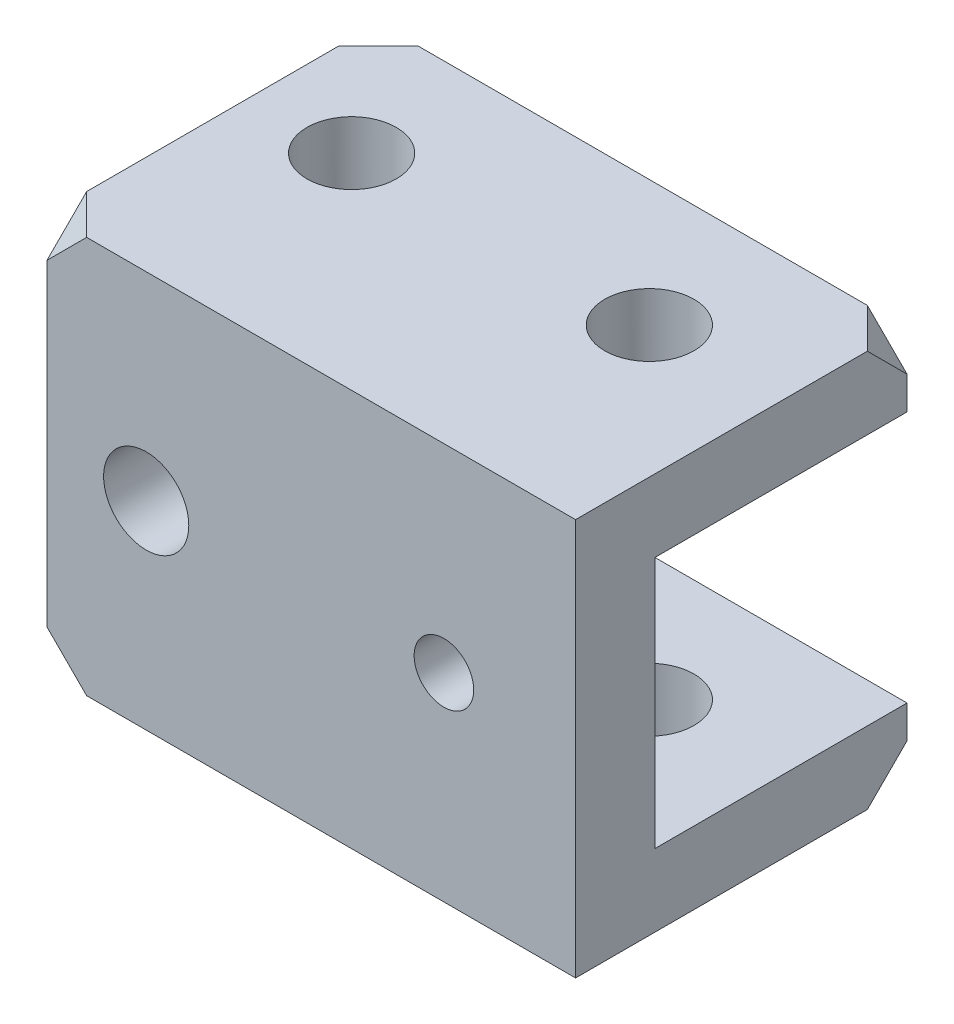
ISO-10303-21;
HEADER;
FILE_DESCRIPTION(('STEP AP214'),'2;1');
FILE_NAME('part.step','',(''),(''),'','','');
FILE_SCHEMA(('AUTOMOTIVE_DESIGN { 1 0 10303 214 1 1 1 1 }'));
ENDSEC;
DATA;
#1=APPLICATION_CONTEXT('core data for automotive mechanical design processes');
#2=APPLICATION_PROTOCOL_DEFINITION('international standard','automotive_design',2000,#1);
#3=PRODUCT_CONTEXT('',#1,'mechanical');
#4=PRODUCT('Part','Part','',(#3));
#5=PRODUCT_RELATED_PRODUCT_CATEGORY('part','',(#4));
#6=PRODUCT_DEFINITION_FORMATION('','',#4);
#7=PRODUCT_DEFINITION_CONTEXT('part definition',#1,'design');
#8=PRODUCT_DEFINITION('design','',#6,#7);
#9=PRODUCT_DEFINITION_SHAPE('','',#8);
#10=(LENGTH_UNIT() NAMED_UNIT(*) SI_UNIT(.MILLI.,.METRE.));
#11=(NAMED_UNIT(*) PLANE_ANGLE_UNIT() SI_UNIT($,.RADIAN.));
#12=(NAMED_UNIT(*) SI_UNIT($,.STERADIAN.) SOLID_ANGLE_UNIT());
#13=UNCERTAINTY_MEASURE_WITH_UNIT(LENGTH_MEASURE(1.E-05),#10,'distance_accuracy_value','');
#14=(GEOMETRIC_REPRESENTATION_CONTEXT(3) GLOBAL_UNCERTAINTY_ASSIGNED_CONTEXT((#13)) GLOBAL_UNIT_ASSIGNED_CONTEXT((#10,
#11,#12)) REPRESENTATION_CONTEXT('',''));
#15=CARTESIAN_POINT('',(0.,0.,0.));
#16=DIRECTION('',(0.,0.,1.));
#17=DIRECTION('',(1.,0.,0.));
#18=AXIS2_PLACEMENT_3D('',#15,#16,#17);
#19=CARTESIAN_POINT('',(0.,0.,-12.7));
#20=DIRECTION('',(0.,0.,-1.));
#21=DIRECTION('',(-1.,0.,0.));
#22=AXIS2_PLACEMENT_3D('',#19,#20,#21);
#23=PLANE('',#22);
#24=DIRECTION('',(0.,-1.,0.));
#25=VECTOR('',#24,1.);
#26=CARTESIAN_POINT('',(-9.69029685310451,-6.35,-12.7));
#27=LINE('',#26,#25);
#28=CARTESIAN_POINT('',(-9.69029685310451,-6.35,-12.7));
#29=VERTEX_POINT('',#28);
#30=CARTESIAN_POINT('',(-9.69029685310451,-8.,-12.7));
#31=VERTEX_POINT('',#30);
#32=EDGE_CURVE('E279',#29,#31,#27,.T.);
#33=ORIENTED_EDGE('',*,*,#32,.T.);
#34=DIRECTION('',(-0.707106781186547,-0.707106781186548,0.));
#35=VECTOR('',#34,1.);
#36=CARTESIAN_POINT('',(-0.845148426552258,0.845148426552258,-12.7));
#37=LINE('',#36,#35);
#38=CARTESIAN_POINT('',(-11.6902968531045,-10.,-12.7));
#39=VERTEX_POINT('',#38);
#40=EDGE_CURVE('E57',#31,#39,#37,.T.);
#41=ORIENTED_EDGE('',*,*,#40,.T.);
#42=DIRECTION('',(-1.,0.,0.));
#43=VECTOR('',#42,1.);
#44=CARTESIAN_POINT('',(-9.69029685310451,-10.,-12.7));
#45=LINE('',#44,#43);
#46=CARTESIAN_POINT('',(-34.3235464338153,-10.,-12.7));
#47=VERTEX_POINT('',#46);
#48=EDGE_CURVE('E285',#39,#47,#45,.T.);
#49=ORIENTED_EDGE('',*,*,#48,.T.);
#50=DIRECTION('',(-0.707106781186547,0.707106781186547,0.));
#51=VECTOR('',#50,1.);
#52=CARTESIAN_POINT('',(-22.1617732169077,-22.1617732169077,-12.7));
#53=LINE('',#52,#51);
#54=CARTESIAN_POINT('',(-36.3235464338153,-8.00000000000001,-12.7));
#55=VERTEX_POINT('',#54);
#56=EDGE_CURVE('E221',#47,#55,#53,.T.);
#57=ORIENTED_EDGE('',*,*,#56,.T.);
#58=DIRECTION('',(0.,1.,0.));
#59=VECTOR('',#58,1.);
#60=CARTESIAN_POINT('',(-36.3235464338153,-10.,-12.7));
#61=LINE('',#60,#59);
#62=CARTESIAN_POINT('',(-36.3235464338153,-6.35,-12.7));
#63=VERTEX_POINT('',#62);
#64=EDGE_CURVE('E291',#55,#63,#61,.T.);
#65=ORIENTED_EDGE('',*,*,#64,.T.);
#66=DIRECTION('',(1.,0.,0.));
#67=VECTOR('',#66,1.);
#68=CARTESIAN_POINT('',(-36.3235464338153,-6.35,-12.7));
#69=LINE('',#68,#67);
#70=EDGE_CURVE('E288',#63,#29,#69,.T.);
#71=ORIENTED_EDGE('',*,*,#70,.T.);
#72=EDGE_LOOP('',(#33,#41,#49,#57,#65,#71));
#73=FACE_BOUND('',#72,.T.);
#74=ADVANCED_FACE('F47',(#73),#23,.T.);
#75=CARTESIAN_POINT('',(-22.9567960145261,-10.,4.));
#76=DIRECTION('',(0.,-1.,0.));
#77=DIRECTION('',(0.,0.,-1.));
#78=AXIS2_PLACEMENT_3D('',#75,#76,#77);
#79=PLANE('',#78);
#80=CARTESIAN_POINT('',(-31.3235464338153,-10.,-6.35));
#81=DIRECTION('',(0.,-1.,0.));
#82=DIRECTION('',(0.,0.,-1.));
#83=AXIS2_PLACEMENT_3D('',#80,#81,#82);
#84=CIRCLE('',#83,2.24999999999999);
#85=CARTESIAN_POINT('',(-31.3235464338153,-10.,-8.59999999999999));
#86=VERTEX_POINT('',#85);
#87=EDGE_CURVE('E245',#86,#86,#84,.T.);
#88=ORIENTED_EDGE('',*,*,#87,.F.);
#89=EDGE_LOOP('',(#88));
#90=FACE_BOUND('',#89,.T.);
#91=CARTESIAN_POINT('',(-16.3235464338153,-10.,-6.35));
#92=DIRECTION('',(0.,-1.,0.));
#93=DIRECTION('',(0.,0.,-1.));
#94=AXIS2_PLACEMENT_3D('',#91,#92,#93);
#95=CIRCLE('',#94,2.24999999999999);
#96=CARTESIAN_POINT('',(-16.3235464338153,-10.,-8.59999999999999));
#97=VERTEX_POINT('',#96);
#98=EDGE_CURVE('E244',#97,#97,#95,.T.);
#99=ORIENTED_EDGE('',*,*,#98,.F.);
#100=EDGE_LOOP('',(#99));
#101=FACE_BOUND('',#100,.T.);
#102=ORIENTED_EDGE('',*,*,#48,.F.);
#103=DIRECTION('',(0.707106781186548,0.,0.707106781186548));
#104=VECTOR('',#103,1.);
#105=CARTESIAN_POINT('',(-8.97354643381531,-10.,-9.9832495807108));
#106=LINE('',#105,#104);
#107=CARTESIAN_POINT('',(-9.69029685310451,-10.,-10.7));
#108=VERTEX_POINT('',#107);
#109=EDGE_CURVE('E236',#39,#108,#106,.T.);
#110=ORIENTED_EDGE('',*,*,#109,.T.);
#111=DIRECTION('',(0.,0.,-1.));
#112=VECTOR('',#111,1.);
#113=CARTESIAN_POINT('',(-9.69029685310451,-10.,4.));
#114=LINE('',#113,#112);
#115=CARTESIAN_POINT('',(-9.69029685310451,-10.,4.));
#116=VERTEX_POINT('',#115);
#117=EDGE_CURVE('E177',#116,#108,#114,.T.);
#118=ORIENTED_EDGE('',*,*,#117,.F.);
#119=DIRECTION('',(-1.,0.,0.));
#120=VECTOR('',#119,1.);
#121=CARTESIAN_POINT('',(-22.9567960145261,-10.,4.));
#122=LINE('',#121,#120);
#123=CARTESIAN_POINT('',(-34.3235464338153,-10.,4.));
#124=VERTEX_POINT('',#123);
#125=EDGE_CURVE('E167',#116,#124,#122,.T.);
#126=ORIENTED_EDGE('',*,*,#125,.T.);
#127=DIRECTION('',(-0.707106781186548,0.,-0.707106781186547));
#128=VECTOR('',#127,1.);
#129=CARTESIAN_POINT('',(-28.6401712241707,-10.,9.68337520964459));
#130=LINE('',#129,#128);
#131=CARTESIAN_POINT('',(-36.3235464338153,-10.,1.99999999999998));
#132=VERTEX_POINT('',#131);
#133=EDGE_CURVE('E225',#124,#132,#130,.T.);
#134=ORIENTED_EDGE('',*,*,#133,.T.);
#135=DIRECTION('',(0.,0.,-1.));
#136=VECTOR('',#135,1.);
#137=CARTESIAN_POINT('',(-36.3235464338153,-10.,4.));
#138=LINE('',#137,#136);
#139=CARTESIAN_POINT('',(-36.3235464338153,-10.,-10.7));
#140=VERTEX_POINT('',#139);
#141=EDGE_CURVE('E184',#132,#140,#138,.T.);
#142=ORIENTED_EDGE('',*,*,#141,.T.);
#143=DIRECTION('',(0.707106781186547,0.,-0.707106781186547));
#144=VECTOR('',#143,1.);
#145=CARTESIAN_POINT('',(-36.9901712241707,-10.,-10.0333752096446));
#146=LINE('',#145,#144);
#147=EDGE_CURVE('E217',#140,#47,#146,.T.);
#148=ORIENTED_EDGE('',*,*,#147,.T.);
#149=EDGE_LOOP('',(#102,#110,#118,#126,#134,#142,#148));
#150=FACE_BOUND('',#149,.T.);
#151=ADVANCED_FACE('F350',(#90,#101,#150),#79,.T.);
#152=CARTESIAN_POINT('',(-16.3235464338153,0.,4.));
#153=DIRECTION('',(0.,0.,1.));
#154=DIRECTION('',(1.,0.,0.));
#155=AXIS2_PLACEMENT_3D('',#152,#153,#154);
#156=PLANE('',#155);
#157=DIRECTION('',(0.,1.,0.));
#158=VECTOR('',#157,1.);
#159=CARTESIAN_POINT('',(-9.69029685310451,-10.,4.));
#160=LINE('',#159,#158);
#161=CARTESIAN_POINT('',(-9.69029685310451,10.,4.));
#162=VERTEX_POINT('',#161);
#163=EDGE_CURVE('E161',#116,#162,#160,.T.);
#164=ORIENTED_EDGE('',*,*,#163,.T.);
#165=DIRECTION('',(-1.,0.,0.));
#166=VECTOR('',#165,1.);
#167=CARTESIAN_POINT('',(-22.9567960145261,10.,4.));
#168=LINE('',#167,#166);
#169=CARTESIAN_POINT('',(-34.3235464338153,10.,4.));
#170=VERTEX_POINT('',#169);
#171=EDGE_CURVE('E149',#162,#170,#168,.T.);
#172=ORIENTED_EDGE('',*,*,#171,.T.);
#173=DIRECTION('',(-0.707106781186548,-0.707106781186548,0.));
#174=VECTOR('',#173,1.);
#175=CARTESIAN_POINT('',(-30.3235464338153,14.,4.));
#176=LINE('',#175,#174);
#177=CARTESIAN_POINT('',(-36.3235464338153,7.99999999999998,4.));
#178=VERTEX_POINT('',#177);
#179=EDGE_CURVE('E211',#170,#178,#176,.T.);
#180=ORIENTED_EDGE('',*,*,#179,.T.);
#181=DIRECTION('',(0.,-1.,0.));
#182=VECTOR('',#181,1.);
#183=CARTESIAN_POINT('',(-36.3235464338153,10.,4.));
#184=LINE('',#183,#182);
#185=CARTESIAN_POINT('',(-36.3235464338153,-7.99999999999998,4.));
#186=VERTEX_POINT('',#185);
#187=EDGE_CURVE('E160',#178,#186,#184,.T.);
#188=ORIENTED_EDGE('',*,*,#187,.T.);
#189=DIRECTION('',(0.707106781186548,-0.707106781186548,0.));
#190=VECTOR('',#189,1.);
#191=CARTESIAN_POINT('',(-30.3235464338153,-14.,4.));
#192=LINE('',#191,#190);
#193=EDGE_CURVE('E229',#186,#124,#192,.T.);
#194=ORIENTED_EDGE('',*,*,#193,.T.);
#195=ORIENTED_EDGE('',*,*,#125,.F.);
#196=EDGE_LOOP('',(#164,#172,#180,#188,#194,#195));
#197=FACE_BOUND('',#196,.T.);
#198=CARTESIAN_POINT('',(-16.3235464338153,0.,4.));
#199=DIRECTION('',(0.,0.,1.));
#200=DIRECTION('',(1.,0.,0.));
#201=AXIS2_PLACEMENT_3D('',#198,#199,#200);
#202=CIRCLE('',#201,1.5);
#203=CARTESIAN_POINT('',(-14.8235464338153,0.,4.));
#204=VERTEX_POINT('',#203);
#205=EDGE_CURVE('E333',#204,#204,#202,.T.);
#206=ORIENTED_EDGE('',*,*,#205,.F.);
#207=EDGE_LOOP('',(#206));
#208=FACE_BOUND('',#207,.T.);
#209=CARTESIAN_POINT('',(-31.3235464338153,0.,4.));
#210=DIRECTION('',(0.,0.,1.));
#211=DIRECTION('',(1.,0.,0.));
#212=AXIS2_PLACEMENT_3D('',#209,#210,#211);
#213=CIRCLE('',#212,2.145);
#214=CARTESIAN_POINT('',(-29.1785464338153,0.,4.));
#215=VERTEX_POINT('',#214);
#216=EDGE_CURVE('E326',#215,#215,#213,.T.);
#217=ORIENTED_EDGE('',*,*,#216,.F.);
#218=EDGE_LOOP('',(#217));
#219=FACE_BOUND('',#218,.T.);
#220=ADVANCED_FACE('F164',(#197,#208,#219),#156,.T.);
#221=CARTESIAN_POINT('',(0.,0.,-12.7));
#222=DIRECTION('',(0.,0.,-1.));
#223=DIRECTION('',(-1.,0.,0.));
#224=AXIS2_PLACEMENT_3D('',#221,#222,#223);
#225=PLANE('',#224);
#226=DIRECTION('',(1.,0.,0.));
#227=VECTOR('',#226,1.);
#228=CARTESIAN_POINT('',(-9.69029685310451,10.,-12.7));
#229=LINE('',#228,#227);
#230=CARTESIAN_POINT('',(-34.3235464338153,10.,-12.7));
#231=VERTEX_POINT('',#230);
#232=CARTESIAN_POINT('',(-11.6902968531045,10.,-12.7));
#233=VERTEX_POINT('',#232);
#234=EDGE_CURVE('E296',#231,#233,#229,.T.);
#235=ORIENTED_EDGE('',*,*,#234,.T.);
#236=DIRECTION('',(0.707106781186547,-0.707106781186547,0.));
#237=VECTOR('',#236,1.);
#238=CARTESIAN_POINT('',(-0.845148426552257,-0.845148426552257,-12.7));
#239=LINE('',#238,#237);
#240=CARTESIAN_POINT('',(-9.69029685310451,7.99999999999999,-12.7));
#241=VERTEX_POINT('',#240);
#242=EDGE_CURVE('E198',#233,#241,#239,.T.);
#243=ORIENTED_EDGE('',*,*,#242,.T.);
#244=DIRECTION('',(0.,-1.,0.));
#245=VECTOR('',#244,1.);
#246=CARTESIAN_POINT('',(-9.69029685310451,10.,-12.7));
#247=LINE('',#246,#245);
#248=CARTESIAN_POINT('',(-9.69029685310451,6.35,-12.7));
#249=VERTEX_POINT('',#248);
#250=EDGE_CURVE('E300',#241,#249,#247,.T.);
#251=ORIENTED_EDGE('',*,*,#250,.T.);
#252=DIRECTION('',(-1.,0.,0.));
#253=VECTOR('',#252,1.);
#254=CARTESIAN_POINT('',(-9.69029685310451,6.35,-12.7));
#255=LINE('',#254,#253);
#256=CARTESIAN_POINT('',(-36.3235464338153,6.35,-12.7));
#257=VERTEX_POINT('',#256);
#258=EDGE_CURVE('E303',#249,#257,#255,.T.);
#259=ORIENTED_EDGE('',*,*,#258,.T.);
#260=DIRECTION('',(0.,1.,0.));
#261=VECTOR('',#260,1.);
#262=CARTESIAN_POINT('',(-36.3235464338153,6.35,-12.7));
#263=LINE('',#262,#261);
#264=CARTESIAN_POINT('',(-36.3235464338153,8.00000000000001,-12.7));
#265=VERTEX_POINT('',#264);
#266=EDGE_CURVE('E306',#257,#265,#263,.T.);
#267=ORIENTED_EDGE('',*,*,#266,.T.);
#268=DIRECTION('',(0.707106781186547,0.707106781186547,0.));
#269=VECTOR('',#268,1.);
#270=CARTESIAN_POINT('',(-22.1617732169077,22.1617732169077,-12.7));
#271=LINE('',#270,#269);
#272=EDGE_CURVE('E194',#265,#231,#271,.T.);
#273=ORIENTED_EDGE('',*,*,#272,.T.);
#274=EDGE_LOOP('',(#235,#243,#251,#259,#267,#273));
#275=FACE_BOUND('',#274,.T.);
#276=ADVANCED_FACE('F390',(#275),#225,.T.);
#277=CARTESIAN_POINT('',(-16.3235464338153,0.,0.));
#278=DIRECTION('',(0.,0.,1.));
#279=DIRECTION('',(1.,0.,0.));
#280=AXIS2_PLACEMENT_3D('',#277,#278,#279);
#281=PLANE('',#280);
#282=CARTESIAN_POINT('',(-16.3235464338153,0.,0.));
#283=DIRECTION('',(0.,0.,1.));
#284=DIRECTION('',(1.,0.,0.));
#285=AXIS2_PLACEMENT_3D('',#282,#283,#284);
#286=CIRCLE('',#285,1.5);
#287=CARTESIAN_POINT('',(-14.8235464338153,0.,0.));
#288=VERTEX_POINT('',#287);
#289=EDGE_CURVE('E322',#288,#288,#286,.T.);
#290=ORIENTED_EDGE('',*,*,#289,.T.);
#291=EDGE_LOOP('',(#290));
#292=FACE_BOUND('',#291,.T.);
#293=CARTESIAN_POINT('',(-31.3235464338153,0.,0.));
#294=DIRECTION('',(0.,0.,1.));
#295=DIRECTION('',(1.,0.,0.));
#296=AXIS2_PLACEMENT_3D('',#293,#294,#295);
#297=CIRCLE('',#296,2.145);
#298=CARTESIAN_POINT('',(-29.1785464338153,0.,0.));
#299=VERTEX_POINT('',#298);
#300=EDGE_CURVE('E321',#299,#299,#297,.T.);
#301=ORIENTED_EDGE('',*,*,#300,.T.);
#302=EDGE_LOOP('',(#301));
#303=FACE_BOUND('',#302,.T.);
#304=DIRECTION('',(1.,0.,0.));
#305=VECTOR('',#304,1.);
#306=CARTESIAN_POINT('',(-36.3235464338153,-6.35,0.));
#307=LINE('',#306,#305);
#308=CARTESIAN_POINT('',(-36.3235464338153,-6.35,0.));
#309=VERTEX_POINT('',#308);
#310=CARTESIAN_POINT('',(-9.69029685310451,-6.35,0.));
#311=VERTEX_POINT('',#310);
#312=EDGE_CURVE('E280',#309,#311,#307,.T.);
#313=ORIENTED_EDGE('',*,*,#312,.F.);
#314=DIRECTION('',(0.,-1.,0.));
#315=VECTOR('',#314,1.);
#316=CARTESIAN_POINT('',(-36.3235464338153,10.,0.));
#317=LINE('',#316,#315);
#318=CARTESIAN_POINT('',(-36.3235464338153,6.35,0.));
#319=VERTEX_POINT('',#318);
#320=EDGE_CURVE('E170',#319,#309,#317,.T.);
#321=ORIENTED_EDGE('',*,*,#320,.F.);
#322=DIRECTION('',(-1.,0.,0.));
#323=VECTOR('',#322,1.);
#324=CARTESIAN_POINT('',(-9.69029685310451,6.35,0.));
#325=LINE('',#324,#323);
#326=CARTESIAN_POINT('',(-9.69029685310451,6.35,0.));
#327=VERTEX_POINT('',#326);
#328=EDGE_CURVE('E284',#327,#319,#325,.T.);
#329=ORIENTED_EDGE('',*,*,#328,.F.);
#330=DIRECTION('',(0.,1.,0.));
#331=VECTOR('',#330,1.);
#332=CARTESIAN_POINT('',(-9.69029685310451,-10.,0.));
#333=LINE('',#332,#331);
#334=EDGE_CURVE('E336',#311,#327,#333,.T.);
#335=ORIENTED_EDGE('',*,*,#334,.F.);
#336=EDGE_LOOP('',(#313,#321,#329,#335));
#337=FACE_BOUND('',#336,.T.);
#338=ADVANCED_FACE('F393',(#292,#303,#337),#281,.F.);
#339=CARTESIAN_POINT('',(-9.69029685310451,-10.,4.));
#340=DIRECTION('',(-1.,0.,0.));
#341=DIRECTION('',(0.,0.,1.));
#342=AXIS2_PLACEMENT_3D('',#339,#340,#341);
#343=PLANE('',#342);
#344=DIRECTION('',(0.,-0.707106781186548,0.707106781186547));
#345=VECTOR('',#344,1.);
#346=CARTESIAN_POINT('',(-9.69029685310451,-17.35,-3.35000000000001));
#347=LINE('',#346,#345);
#348=EDGE_CURVE('E11',#31,#108,#347,.T.);
#349=ORIENTED_EDGE('',*,*,#348,.F.);
#350=ORIENTED_EDGE('',*,*,#32,.F.);
#351=DIRECTION('',(0.,0.,1.));
#352=VECTOR('',#351,1.);
#353=CARTESIAN_POINT('',(-9.69029685310451,-6.35,-12.7));
#354=LINE('',#353,#352);
#355=EDGE_CURVE('E275',#29,#311,#354,.T.);
#356=ORIENTED_EDGE('',*,*,#355,.T.);
#357=ORIENTED_EDGE('',*,*,#334,.T.);
#358=DIRECTION('',(0.,0.,1.));
#359=VECTOR('',#358,1.);
#360=CARTESIAN_POINT('',(-9.69029685310451,6.35,-12.7));
#361=LINE('',#360,#359);
#362=EDGE_CURVE('E317',#249,#327,#361,.T.);
#363=ORIENTED_EDGE('',*,*,#362,.F.);
#364=ORIENTED_EDGE('',*,*,#250,.F.);
#365=DIRECTION('',(0.,-0.707106781186547,-0.707106781186547));
#366=VECTOR('',#365,1.);
#367=CARTESIAN_POINT('',(-9.69029685310451,7.35,-13.35));
#368=LINE('',#367,#366);
#369=CARTESIAN_POINT('',(-9.69029685310451,10.,-10.7));
#370=VERTEX_POINT('',#369);
#371=EDGE_CURVE('E174',#370,#241,#368,.T.);
#372=ORIENTED_EDGE('',*,*,#371,.F.);
#373=DIRECTION('',(0.,0.,-1.));
#374=VECTOR('',#373,1.);
#375=CARTESIAN_POINT('',(-9.69029685310451,10.,4.));
#376=LINE('',#375,#374);
#377=EDGE_CURVE('E153',#162,#370,#376,.T.);
#378=ORIENTED_EDGE('',*,*,#377,.F.);
#379=ORIENTED_EDGE('',*,*,#163,.F.);
#380=ORIENTED_EDGE('',*,*,#117,.T.);
#381=EDGE_LOOP('',(#349,#350,#356,#357,#363,#364,#372,#378,#379,#380));
#382=FACE_BOUND('',#381,.T.);
#383=ADVANCED_FACE('F49',(#382),#343,.F.);
#384=CARTESIAN_POINT('',(-22.9567960145261,10.,4.));
#385=DIRECTION('',(0.,-1.,0.));
#386=DIRECTION('',(0.,0.,-1.));
#387=AXIS2_PLACEMENT_3D('',#384,#385,#386);
#388=PLANE('',#387);
#389=CARTESIAN_POINT('',(-31.3235464338153,10.,-6.35));
#390=DIRECTION('',(0.,-1.,0.));
#391=DIRECTION('',(0.,0.,-1.));
#392=AXIS2_PLACEMENT_3D('',#389,#390,#391);
#393=CIRCLE('',#392,2.24999999999999);
#394=CARTESIAN_POINT('',(-31.3235464338153,10.,-8.59999999999999));
#395=VERTEX_POINT('',#394);
#396=EDGE_CURVE('E254',#395,#395,#393,.T.);
#397=ORIENTED_EDGE('',*,*,#396,.T.);
#398=EDGE_LOOP('',(#397));
#399=FACE_BOUND('',#398,.T.);
#400=CARTESIAN_POINT('',(-16.3235464338153,10.,-6.35));
#401=DIRECTION('',(0.,-1.,0.));
#402=DIRECTION('',(0.,0.,-1.));
#403=AXIS2_PLACEMENT_3D('',#400,#401,#402);
#404=CIRCLE('',#403,2.24999999999999);
#405=CARTESIAN_POINT('',(-16.3235464338153,10.,-8.59999999999999));
#406=VERTEX_POINT('',#405);
#407=EDGE_CURVE('E241',#406,#406,#404,.T.);
#408=ORIENTED_EDGE('',*,*,#407,.T.);
#409=EDGE_LOOP('',(#408));
#410=FACE_BOUND('',#409,.T.);
#411=DIRECTION('',(-0.707106781186548,0.,-0.707106781186547));
#412=VECTOR('',#411,1.);
#413=CARTESIAN_POINT('',(-28.6401712241707,10.,9.68337520964459));
#414=LINE('',#413,#412);
#415=CARTESIAN_POINT('',(-36.3235464338153,10.,1.99999999999998));
#416=VERTEX_POINT('',#415);
#417=EDGE_CURVE('E156',#170,#416,#414,.T.);
#418=ORIENTED_EDGE('',*,*,#417,.F.);
#419=ORIENTED_EDGE('',*,*,#171,.F.);
#420=ORIENTED_EDGE('',*,*,#377,.T.);
#421=DIRECTION('',(0.707106781186547,0.,0.707106781186547));
#422=VECTOR('',#421,1.);
#423=CARTESIAN_POINT('',(-8.97354643381532,10.,-9.9832495807108));
#424=LINE('',#423,#422);
#425=EDGE_CURVE('E203',#233,#370,#424,.T.);
#426=ORIENTED_EDGE('',*,*,#425,.F.);
#427=ORIENTED_EDGE('',*,*,#234,.F.);
#428=DIRECTION('',(0.707106781186547,0.,-0.707106781186547));
#429=VECTOR('',#428,1.);
#430=CARTESIAN_POINT('',(-36.9901712241707,10.,-10.0333752096446));
#431=LINE('',#430,#429);
#432=CARTESIAN_POINT('',(-36.3235464338153,10.,-10.7));
#433=VERTEX_POINT('',#432);
#434=EDGE_CURVE('E182',#433,#231,#431,.T.);
#435=ORIENTED_EDGE('',*,*,#434,.F.);
#436=DIRECTION('',(0.,0.,-1.));
#437=VECTOR('',#436,1.);
#438=CARTESIAN_POINT('',(-36.3235464338153,10.,4.));
#439=LINE('',#438,#437);
#440=EDGE_CURVE('E178',#416,#433,#439,.T.);
#441=ORIENTED_EDGE('',*,*,#440,.F.);
#442=EDGE_LOOP('',(#418,#419,#420,#426,#427,#435,#441));
#443=FACE_BOUND('',#442,.T.);
#444=ADVANCED_FACE('F151',(#399,#410,#443),#388,.F.);
#445=CARTESIAN_POINT('',(-36.3235464338153,10.,4.));
#446=DIRECTION('',(1.,0.,0.));
#447=DIRECTION('',(0.,0.,-1.));
#448=AXIS2_PLACEMENT_3D('',#445,#446,#447);
#449=PLANE('',#448);
#450=DIRECTION('',(0.,-0.707106781186548,-0.707106781186547));
#451=VECTOR('',#450,1.);
#452=CARTESIAN_POINT('',(-36.3235464338153,1.00000000000001,13.));
#453=LINE('',#452,#451);
#454=EDGE_CURVE('E232',#186,#132,#453,.T.);
#455=ORIENTED_EDGE('',*,*,#454,.F.);
#456=ORIENTED_EDGE('',*,*,#187,.F.);
#457=DIRECTION('',(0.,-0.707106781186548,0.707106781186547));
#458=VECTOR('',#457,1.);
#459=CARTESIAN_POINT('',(-36.3235464338153,8.99999999999999,2.99999999999999));
#460=LINE('',#459,#458);
#461=EDGE_CURVE('E208',#416,#178,#460,.T.);
#462=ORIENTED_EDGE('',*,*,#461,.F.);
#463=ORIENTED_EDGE('',*,*,#440,.T.);
#464=DIRECTION('',(0.,0.707106781186547,0.707106781186547));
#465=VECTOR('',#464,1.);
#466=CARTESIAN_POINT('',(-36.3235464338153,17.35,-3.35));
#467=LINE('',#466,#465);
#468=EDGE_CURVE('E190',#265,#433,#467,.T.);
#469=ORIENTED_EDGE('',*,*,#468,.F.);
#470=ORIENTED_EDGE('',*,*,#266,.F.);
#471=DIRECTION('',(0.,0.,1.));
#472=VECTOR('',#471,1.);
#473=CARTESIAN_POINT('',(-36.3235464338153,6.35,-12.7));
#474=LINE('',#473,#472);
#475=EDGE_CURVE('E310',#257,#319,#474,.T.);
#476=ORIENTED_EDGE('',*,*,#475,.T.);
#477=ORIENTED_EDGE('',*,*,#320,.T.);
#478=DIRECTION('',(0.,0.,1.));
#479=VECTOR('',#478,1.);
#480=CARTESIAN_POINT('',(-36.3235464338153,-6.35,-12.7));
#481=LINE('',#480,#479);
#482=EDGE_CURVE('E271',#63,#309,#481,.T.);
#483=ORIENTED_EDGE('',*,*,#482,.F.);
#484=ORIENTED_EDGE('',*,*,#64,.F.);
#485=DIRECTION('',(0.,0.707106781186547,-0.707106781186547));
#486=VECTOR('',#485,1.);
#487=CARTESIAN_POINT('',(-36.3235464338153,-7.34999999999999,-13.35));
#488=LINE('',#487,#486);
#489=EDGE_CURVE('E214',#140,#55,#488,.T.);
#490=ORIENTED_EDGE('',*,*,#489,.F.);
#491=ORIENTED_EDGE('',*,*,#141,.F.);
#492=EDGE_LOOP('',(#455,#456,#462,#463,#469,#470,#476,#477,#483,#484,#490,#491));
#493=FACE_BOUND('',#492,.T.);
#494=ADVANCED_FACE('F358',(#493),#449,.F.);
#495=CARTESIAN_POINT('',(-31.3235464338153,0.,0.));
#496=DIRECTION('',(0.,0.,1.));
#497=DIRECTION('',(1.,0.,0.));
#498=AXIS2_PLACEMENT_3D('',#495,#496,#497);
#499=CYLINDRICAL_SURFACE('',#498,2.145);
#500=ORIENTED_EDGE('',*,*,#216,.T.);
#501=EDGE_LOOP('',(#500));
#502=FACE_BOUND('',#501,.T.);
#503=ORIENTED_EDGE('',*,*,#300,.F.);
#504=EDGE_LOOP('',(#503));
#505=FACE_BOUND('',#504,.T.);
#506=ADVANCED_FACE('F401',(#502,#505),#499,.F.);
#507=CARTESIAN_POINT('',(-16.3235464338153,0.,0.));
#508=DIRECTION('',(0.,0.,1.));
#509=DIRECTION('',(1.,0.,0.));
#510=AXIS2_PLACEMENT_3D('',#507,#508,#509);
#511=CYLINDRICAL_SURFACE('',#510,1.5);
#512=ORIENTED_EDGE('',*,*,#205,.T.);
#513=EDGE_LOOP('',(#512));
#514=FACE_BOUND('',#513,.T.);
#515=ORIENTED_EDGE('',*,*,#289,.F.);
#516=EDGE_LOOP('',(#515));
#517=FACE_BOUND('',#516,.T.);
#518=ADVANCED_FACE('F397',(#514,#517),#511,.F.);
#519=CARTESIAN_POINT('',(-9.69029685310451,6.35,-12.7));
#520=DIRECTION('',(0.,1.,0.));
#521=DIRECTION('',(0.,0.,1.));
#522=AXIS2_PLACEMENT_3D('',#519,#520,#521);
#523=PLANE('',#522);
#524=CARTESIAN_POINT('',(-31.3235464338153,6.35,-6.35));
#525=DIRECTION('',(0.,1.,0.));
#526=DIRECTION('',(0.,0.,1.));
#527=AXIS2_PLACEMENT_3D('',#524,#525,#526);
#528=CIRCLE('',#527,2.24999999999999);
#529=CARTESIAN_POINT('',(-31.3235464338153,6.35,-4.10000000000001));
#530=VERTEX_POINT('',#529);
#531=EDGE_CURVE('E260',#530,#530,#528,.T.);
#532=ORIENTED_EDGE('',*,*,#531,.T.);
#533=EDGE_LOOP('',(#532));
#534=FACE_BOUND('',#533,.T.);
#535=CARTESIAN_POINT('',(-16.3235464338153,6.35,-6.35));
#536=DIRECTION('',(0.,1.,0.));
#537=DIRECTION('',(0.,0.,1.));
#538=AXIS2_PLACEMENT_3D('',#535,#536,#537);
#539=CIRCLE('',#538,2.24999999999999);
#540=CARTESIAN_POINT('',(-16.3235464338153,6.35,-4.10000000000001));
#541=VERTEX_POINT('',#540);
#542=EDGE_CURVE('E267',#541,#541,#539,.T.);
#543=ORIENTED_EDGE('',*,*,#542,.T.);
#544=EDGE_LOOP('',(#543));
#545=FACE_BOUND('',#544,.T.);
#546=ORIENTED_EDGE('',*,*,#328,.T.);
#547=ORIENTED_EDGE('',*,*,#475,.F.);
#548=ORIENTED_EDGE('',*,*,#258,.F.);
#549=ORIENTED_EDGE('',*,*,#362,.T.);
#550=EDGE_LOOP('',(#546,#547,#548,#549));
#551=FACE_BOUND('',#550,.T.);
#552=ADVANCED_FACE('F395',(#534,#545,#551),#523,.F.);
#553=CARTESIAN_POINT('',(-36.3235464338153,-6.35,-12.7));
#554=DIRECTION('',(0.,-1.,0.));
#555=DIRECTION('',(1.,0.,0.));
#556=AXIS2_PLACEMENT_3D('',#553,#554,#555);
#557=PLANE('',#556);
#558=CARTESIAN_POINT('',(-31.3235464338153,-6.35,-6.35));
#559=DIRECTION('',(0.,-1.,0.));
#560=DIRECTION('',(1.,0.,0.));
#561=AXIS2_PLACEMENT_3D('',#558,#559,#560);
#562=CIRCLE('',#561,2.24999999999999);
#563=CARTESIAN_POINT('',(-29.0735464338153,-6.35,-6.35));
#564=VERTEX_POINT('',#563);
#565=EDGE_CURVE('E51',#564,#564,#562,.T.);
#566=ORIENTED_EDGE('',*,*,#565,.T.);
#567=EDGE_LOOP('',(#566));
#568=FACE_BOUND('',#567,.T.);
#569=CARTESIAN_POINT('',(-16.3235464338153,-6.35,-6.35));
#570=DIRECTION('',(0.,-1.,0.));
#571=DIRECTION('',(1.,0.,0.));
#572=AXIS2_PLACEMENT_3D('',#569,#570,#571);
#573=CIRCLE('',#572,2.24999999999999);
#574=CARTESIAN_POINT('',(-14.0735464338153,-6.35,-6.35));
#575=VERTEX_POINT('',#574);
#576=EDGE_CURVE('E251',#575,#575,#573,.T.);
#577=ORIENTED_EDGE('',*,*,#576,.T.);
#578=EDGE_LOOP('',(#577));
#579=FACE_BOUND('',#578,.T.);
#580=ORIENTED_EDGE('',*,*,#312,.T.);
#581=ORIENTED_EDGE('',*,*,#355,.F.);
#582=ORIENTED_EDGE('',*,*,#70,.F.);
#583=ORIENTED_EDGE('',*,*,#482,.T.);
#584=EDGE_LOOP('',(#580,#581,#582,#583));
#585=FACE_BOUND('',#584,.T.);
#586=ADVANCED_FACE('F388',(#568,#579,#585),#557,.F.);
#587=CARTESIAN_POINT('',(-19.0078488112718,19.0078488112718,-19.0078488112718));
#588=DIRECTION('',(-0.577350269189626,0.577350269189626,-0.577350269189626));
#589=DIRECTION('',(-0.707106781186547,0.,0.707106781186547));
#590=AXIS2_PLACEMENT_3D('',#587,#588,#589);
#591=PLANE('',#590);
#592=ORIENTED_EDGE('',*,*,#468,.T.);
#593=ORIENTED_EDGE('',*,*,#434,.T.);
#594=ORIENTED_EDGE('',*,*,#272,.F.);
#595=EDGE_LOOP('',(#592,#593,#594));
#596=FACE_BOUND('',#595,.T.);
#597=ADVANCED_FACE('F437',(#596),#591,.T.);
#598=CARTESIAN_POINT('',(3.66990104896516,3.66990104896516,-3.66990104896516));
#599=DIRECTION('',(0.577350269189626,0.577350269189626,-0.577350269189626));
#600=DIRECTION('',(-0.707106781186547,0.,-0.707106781186547));
#601=AXIS2_PLACEMENT_3D('',#598,#599,#600);
#602=PLANE('',#601);
#603=ORIENTED_EDGE('',*,*,#242,.F.);
#604=ORIENTED_EDGE('',*,*,#425,.T.);
#605=ORIENTED_EDGE('',*,*,#371,.T.);
#606=EDGE_LOOP('',(#603,#604,#605));
#607=FACE_BOUND('',#606,.T.);
#608=ADVANCED_FACE('F449',(#607),#602,.T.);
#609=CARTESIAN_POINT('',(-16.1078488112718,16.1078488112718,16.1078488112718));
#610=DIRECTION('',(-0.577350269189626,0.577350269189626,0.577350269189626));
#611=DIRECTION('',(0.707106781186548,0.,0.707106781186547));
#612=AXIS2_PLACEMENT_3D('',#609,#610,#611);
#613=PLANE('',#612);
#614=ORIENTED_EDGE('',*,*,#179,.F.);
#615=ORIENTED_EDGE('',*,*,#417,.T.);
#616=ORIENTED_EDGE('',*,*,#461,.T.);
#617=EDGE_LOOP('',(#614,#615,#616));
#618=FACE_BOUND('',#617,.T.);
#619=ADVANCED_FACE('F457',(#618),#613,.T.);
#620=CARTESIAN_POINT('',(-19.0078488112718,-19.0078488112718,-19.0078488112718));
#621=DIRECTION('',(-0.577350269189626,-0.577350269189626,-0.577350269189626));
#622=DIRECTION('',(-0.707106781186547,0.,0.707106781186547));
#623=AXIS2_PLACEMENT_3D('',#620,#621,#622);
#624=PLANE('',#623);
#625=ORIENTED_EDGE('',*,*,#147,.F.);
#626=ORIENTED_EDGE('',*,*,#489,.T.);
#627=ORIENTED_EDGE('',*,*,#56,.F.);
#628=EDGE_LOOP('',(#625,#626,#627));
#629=FACE_BOUND('',#628,.T.);
#630=ADVANCED_FACE('F356',(#629),#624,.T.);
#631=CARTESIAN_POINT('',(-16.1078488112718,-16.1078488112718,16.1078488112718));
#632=DIRECTION('',(-0.577350269189626,-0.577350269189626,0.577350269189626));
#633=DIRECTION('',(0.707106781186548,0.,0.707106781186547));
#634=AXIS2_PLACEMENT_3D('',#631,#632,#633);
#635=PLANE('',#634);
#636=ORIENTED_EDGE('',*,*,#133,.F.);
#637=ORIENTED_EDGE('',*,*,#193,.F.);
#638=ORIENTED_EDGE('',*,*,#454,.T.);
#639=EDGE_LOOP('',(#636,#637,#638));
#640=FACE_BOUND('',#639,.T.);
#641=ADVANCED_FACE('F367',(#640),#635,.T.);
#642=CARTESIAN_POINT('',(3.66990104896516,-3.66990104896516,-3.66990104896516));
#643=DIRECTION('',(0.577350269189626,-0.577350269189626,-0.577350269189626));
#644=DIRECTION('',(-0.707106781186548,0.,-0.707106781186548));
#645=AXIS2_PLACEMENT_3D('',#642,#643,#644);
#646=PLANE('',#645);
#647=ORIENTED_EDGE('',*,*,#109,.F.);
#648=ORIENTED_EDGE('',*,*,#40,.F.);
#649=ORIENTED_EDGE('',*,*,#348,.T.);
#650=EDGE_LOOP('',(#647,#648,#649));
#651=FACE_BOUND('',#650,.T.);
#652=ADVANCED_FACE('F364',(#651),#646,.T.);
#653=CARTESIAN_POINT('',(-16.3235464338153,12.,-6.35));
#654=DIRECTION('',(0.,1.,0.));
#655=DIRECTION('',(0.,0.,1.));
#656=AXIS2_PLACEMENT_3D('',#653,#654,#655);
#657=CYLINDRICAL_SURFACE('',#656,2.24999999999999);
#658=ORIENTED_EDGE('',*,*,#407,.F.);
#659=EDGE_LOOP('',(#658));
#660=FACE_BOUND('',#659,.T.);
#661=ORIENTED_EDGE('',*,*,#542,.F.);
#662=EDGE_LOOP('',(#661));
#663=FACE_BOUND('',#662,.T.);
#664=ADVANCED_FACE('F366',(#660,#663),#657,.F.);
#665=ORIENTED_EDGE('',*,*,#98,.T.);
#666=EDGE_LOOP('',(#665));
#667=FACE_BOUND('',#666,.T.);
#668=ORIENTED_EDGE('',*,*,#576,.F.);
#669=EDGE_LOOP('',(#668));
#670=FACE_BOUND('',#669,.T.);
#671=ADVANCED_FACE('F374',(#667,#670),#657,.F.);
#672=CARTESIAN_POINT('',(-31.3235464338153,12.,-6.35));
#673=DIRECTION('',(0.,1.,0.));
#674=DIRECTION('',(0.,0.,1.));
#675=AXIS2_PLACEMENT_3D('',#672,#673,#674);
#676=CYLINDRICAL_SURFACE('',#675,2.24999999999999);
#677=ORIENTED_EDGE('',*,*,#87,.T.);
#678=EDGE_LOOP('',(#677));
#679=FACE_BOUND('',#678,.T.);
#680=ORIENTED_EDGE('',*,*,#565,.F.);
#681=EDGE_LOOP('',(#680));
#682=FACE_BOUND('',#681,.T.);
#683=ADVANCED_FACE('F421',(#679,#682),#676,.F.);
#684=ORIENTED_EDGE('',*,*,#531,.F.);
#685=EDGE_LOOP('',(#684));
#686=FACE_BOUND('',#685,.T.);
#687=ORIENTED_EDGE('',*,*,#396,.F.);
#688=EDGE_LOOP('',(#687));
#689=FACE_BOUND('',#688,.T.);
#690=ADVANCED_FACE('F419',(#686,#689),#676,.F.);
#691=CLOSED_SHELL('',(#74,#151,#220,#276,#338,#383,#444,#494,#506,#518,#552,#586,#597,#608,#619,
#630,#641,#652,#664,#671,#683,#690));
#692=MANIFOLD_SOLID_BREP('B2',#691);
#693=ADVANCED_BREP_SHAPE_REPRESENTATION('',(#18,#692),#14);
#694=SHAPE_DEFINITION_REPRESENTATION(#9,#693);
ENDSEC;
END-ISO-10303-21;
